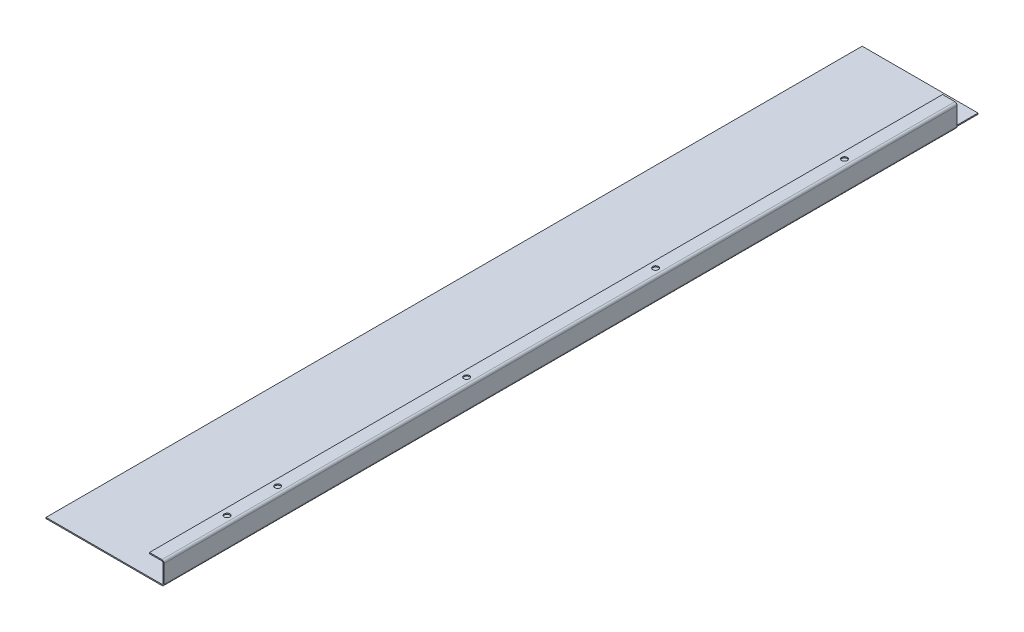
ISO-10303-21;
HEADER;
FILE_DESCRIPTION(('STEP AP214'),'2;1');
FILE_NAME('part.step','',(''),(''),'','','');
FILE_SCHEMA(('AUTOMOTIVE_DESIGN { 1 0 10303 214 1 1 1 1 }'));
ENDSEC;
DATA;
#1=APPLICATION_CONTEXT('core data for automotive mechanical design processes');
#2=APPLICATION_PROTOCOL_DEFINITION('international standard','automotive_design',2000,#1);
#3=PRODUCT_CONTEXT('',#1,'mechanical');
#4=PRODUCT('Part','Part','',(#3));
#5=PRODUCT_RELATED_PRODUCT_CATEGORY('part','',(#4));
#6=PRODUCT_DEFINITION_FORMATION('','',#4);
#7=PRODUCT_DEFINITION_CONTEXT('part definition',#1,'design');
#8=PRODUCT_DEFINITION('design','',#6,#7);
#9=PRODUCT_DEFINITION_SHAPE('','',#8);
#10=(LENGTH_UNIT() NAMED_UNIT(*) SI_UNIT(.MILLI.,.METRE.));
#11=(NAMED_UNIT(*) PLANE_ANGLE_UNIT() SI_UNIT($,.RADIAN.));
#12=(NAMED_UNIT(*) SI_UNIT($,.STERADIAN.) SOLID_ANGLE_UNIT());
#13=UNCERTAINTY_MEASURE_WITH_UNIT(LENGTH_MEASURE(1.E-05),#10,'distance_accuracy_value','');
#14=(GEOMETRIC_REPRESENTATION_CONTEXT(3) GLOBAL_UNCERTAINTY_ASSIGNED_CONTEXT((#13)) GLOBAL_UNIT_ASSIGNED_CONTEXT((#10,
#11,#12)) REPRESENTATION_CONTEXT('',''));
#15=CARTESIAN_POINT('',(0.,0.,0.));
#16=DIRECTION('',(0.,0.,1.));
#17=DIRECTION('',(1.,0.,0.));
#18=AXIS2_PLACEMENT_3D('',#15,#16,#17);
#19=CARTESIAN_POINT('',(105.,-3.86956670765295E-13,0.));
#20=DIRECTION('',(-1.,0.,0.));
#21=DIRECTION('',(0.,-1.,0.));
#22=AXIS2_PLACEMENT_3D('',#19,#20,#21);
#23=PLANE('',#22);
#24=DIRECTION('',(0.,-1.,0.));
#25=VECTOR('',#24,1.);
#26=CARTESIAN_POINT('',(105.,-3.83465189426452E-13,-705.2));
#27=LINE('',#26,#25);
#28=CARTESIAN_POINT('',(105.,17.,-705.2));
#29=VERTEX_POINT('',#28);
#30=CARTESIAN_POINT('',(105.,0.999999999999959,-705.2));
#31=VERTEX_POINT('',#30);
#32=EDGE_CURVE('E346',#29,#31,#27,.T.);
#33=ORIENTED_EDGE('',*,*,#32,.F.);
#34=DIRECTION('',(0.,0.,-1.));
#35=VECTOR('',#34,1.);
#36=CARTESIAN_POINT('',(105.,17.,-725.7));
#37=LINE('',#36,#35);
#38=CARTESIAN_POINT('',(105.,17.,0.));
#39=VERTEX_POINT('',#38);
#40=EDGE_CURVE('E216',#29,#39,#37,.F.);
#41=ORIENTED_EDGE('',*,*,#40,.T.);
#42=DIRECTION('',(0.,-1.,0.));
#43=VECTOR('',#42,1.);
#44=CARTESIAN_POINT('',(105.,-3.86956670765295E-13,0.));
#45=LINE('',#44,#43);
#46=CARTESIAN_POINT('',(105.,0.999999999999983,0.));
#47=VERTEX_POINT('',#46);
#48=EDGE_CURVE('E229',#39,#47,#45,.T.);
#49=ORIENTED_EDGE('',*,*,#48,.T.);
#50=DIRECTION('',(0.,0.,-1.));
#51=VECTOR('',#50,1.);
#52=CARTESIAN_POINT('',(105.,0.999999999999997,0.));
#53=LINE('',#52,#51);
#54=EDGE_CURVE('E235',#31,#47,#53,.F.);
#55=ORIENTED_EDGE('',*,*,#54,.F.);
#56=EDGE_LOOP('',(#33,#41,#49,#55));
#57=FACE_BOUND('',#56,.T.);
#58=ADVANCED_FACE('F78',(#57),#23,.F.);
#59=CARTESIAN_POINT('',(104.,-3.83465189426452E-13,0.));
#60=DIRECTION('',(-1.,0.,0.));
#61=DIRECTION('',(0.,-1.,0.));
#62=AXIS2_PLACEMENT_3D('',#59,#60,#61);
#63=PLANE('',#62);
#64=DIRECTION('',(0.,0.,-1.));
#65=VECTOR('',#64,1.);
#66=CARTESIAN_POINT('',(104.,17.,-725.7));
#67=LINE('',#66,#65);
#68=CARTESIAN_POINT('',(104.,17.,-705.2));
#69=VERTEX_POINT('',#68);
#70=CARTESIAN_POINT('',(104.,17.,0.));
#71=VERTEX_POINT('',#70);
#72=EDGE_CURVE('E223',#69,#71,#67,.F.);
#73=ORIENTED_EDGE('',*,*,#72,.F.);
#74=DIRECTION('',(0.,-1.,0.));
#75=VECTOR('',#74,1.);
#76=CARTESIAN_POINT('',(104.,-3.83304621342186E-13,-705.2));
#77=LINE('',#76,#75);
#78=CARTESIAN_POINT('',(104.,0.999999999999987,-705.2));
#79=VERTEX_POINT('',#78);
#80=EDGE_CURVE('E347',#69,#79,#77,.T.);
#81=ORIENTED_EDGE('',*,*,#80,.T.);
#82=DIRECTION('',(0.,0.,-1.));
#83=VECTOR('',#82,1.);
#84=CARTESIAN_POINT('',(104.,1.,0.));
#85=LINE('',#84,#83);
#86=CARTESIAN_POINT('',(104.,0.999999999999987,0.));
#87=VERTEX_POINT('',#86);
#88=EDGE_CURVE('E237',#87,#79,#85,.T.);
#89=ORIENTED_EDGE('',*,*,#88,.F.);
#90=DIRECTION('',(0.,1.,0.));
#91=VECTOR('',#90,1.);
#92=CARTESIAN_POINT('',(104.,0.,0.));
#93=LINE('',#92,#91);
#94=EDGE_CURVE('E233',#71,#87,#93,.F.);
#95=ORIENTED_EDGE('',*,*,#94,.F.);
#96=EDGE_LOOP('',(#73,#81,#89,#95));
#97=FACE_BOUND('',#96,.T.);
#98=ADVANCED_FACE('F388',(#97),#63,.T.);
#99=CARTESIAN_POINT('',(103.,0.999999999999991,-725.7));
#100=DIRECTION('',(0.,0.,-1.));
#101=DIRECTION('',(1.,0.,0.));
#102=AXIS2_PLACEMENT_3D('',#99,#100,#101);
#103=CYLINDRICAL_SURFACE('',#102,2.00000000000006);
#104=DIRECTION('',(0.,0.,-1.));
#105=VECTOR('',#104,1.);
#106=CARTESIAN_POINT('',(103.,-1.00000000000007,-725.7));
#107=LINE('',#106,#105);
#108=CARTESIAN_POINT('',(103.,-1.00000000000007,-705.2));
#109=VERTEX_POINT('',#108);
#110=CARTESIAN_POINT('',(103.,-1.,0.));
#111=VERTEX_POINT('',#110);
#112=EDGE_CURVE('E103',#109,#111,#107,.F.);
#113=ORIENTED_EDGE('',*,*,#112,.F.);
#114=CARTESIAN_POINT('',(103.,0.999999999999934,-705.2));
#115=DIRECTION('',(0.,0.,1.));
#116=DIRECTION('',(1.,0.,0.));
#117=AXIS2_PLACEMENT_3D('',#114,#115,#116);
#118=CIRCLE('',#117,2.);
#119=EDGE_CURVE('E318',#109,#31,#118,.T.);
#120=ORIENTED_EDGE('',*,*,#119,.T.);
#121=ORIENTED_EDGE('',*,*,#54,.T.);
#122=CARTESIAN_POINT('',(103.,0.999999999999991,0.));
#123=DIRECTION('',(0.,0.,-1.));
#124=DIRECTION('',(-1.,0.,0.));
#125=AXIS2_PLACEMENT_3D('',#122,#123,#124);
#126=CIRCLE('',#125,2.00000000000006);
#127=EDGE_CURVE('E244',#111,#47,#126,.F.);
#128=ORIENTED_EDGE('',*,*,#127,.F.);
#129=EDGE_LOOP('',(#113,#120,#121,#128));
#130=FACE_BOUND('',#129,.T.);
#131=ADVANCED_FACE('F394',(#130),#103,.T.);
#132=CARTESIAN_POINT('',(103.,0.999999999999991,-725.7));
#133=DIRECTION('',(0.,0.,-1.));
#134=DIRECTION('',(1.,0.,0.));
#135=AXIS2_PLACEMENT_3D('',#132,#133,#134);
#136=CYLINDRICAL_SURFACE('',#135,1.00000000000006);
#137=CARTESIAN_POINT('',(103.,0.999999999999934,-705.2));
#138=DIRECTION('',(0.,0.,1.));
#139=DIRECTION('',(1.,0.,0.));
#140=AXIS2_PLACEMENT_3D('',#137,#138,#139);
#141=CIRCLE('',#140,1.);
#142=CARTESIAN_POINT('',(103.,0.,-705.2));
#143=VERTEX_POINT('',#142);
#144=EDGE_CURVE('E324',#143,#79,#141,.T.);
#145=ORIENTED_EDGE('',*,*,#144,.F.);
#146=DIRECTION('',(0.,0.,-1.));
#147=VECTOR('',#146,1.);
#148=CARTESIAN_POINT('',(103.,0.,-725.7));
#149=LINE('',#148,#147);
#150=CARTESIAN_POINT('',(103.,0.,0.));
#151=VERTEX_POINT('',#150);
#152=EDGE_CURVE('E232',#143,#151,#149,.F.);
#153=ORIENTED_EDGE('',*,*,#152,.T.);
#154=CARTESIAN_POINT('',(103.,0.999999999999991,0.));
#155=DIRECTION('',(0.,0.,-1.));
#156=DIRECTION('',(-1.,0.,0.));
#157=AXIS2_PLACEMENT_3D('',#154,#155,#156);
#158=CIRCLE('',#157,1.00000000000006);
#159=EDGE_CURVE('E248',#151,#87,#158,.F.);
#160=ORIENTED_EDGE('',*,*,#159,.T.);
#161=ORIENTED_EDGE('',*,*,#88,.T.);
#162=EDGE_LOOP('',(#145,#153,#160,#161));
#163=FACE_BOUND('',#162,.T.);
#164=ADVANCED_FACE('F409',(#163),#136,.F.);
#165=CARTESIAN_POINT('',(103.,17.,-725.7));
#166=DIRECTION('',(0.,0.,-1.));
#167=DIRECTION('',(0.,1.,0.));
#168=AXIS2_PLACEMENT_3D('',#165,#166,#167);
#169=CYLINDRICAL_SURFACE('',#168,2.);
#170=ORIENTED_EDGE('',*,*,#40,.F.);
#171=CARTESIAN_POINT('',(103.,17.,-705.2));
#172=DIRECTION('',(0.,0.,1.));
#173=DIRECTION('',(1.,0.,0.));
#174=AXIS2_PLACEMENT_3D('',#171,#172,#173);
#175=CIRCLE('',#174,2.);
#176=CARTESIAN_POINT('',(103.,19.0000000000001,-705.2));
#177=VERTEX_POINT('',#176);
#178=EDGE_CURVE('E182',#29,#177,#175,.T.);
#179=ORIENTED_EDGE('',*,*,#178,.T.);
#180=DIRECTION('',(0.,0.,-1.));
#181=VECTOR('',#180,1.);
#182=CARTESIAN_POINT('',(103.,19.,0.));
#183=LINE('',#182,#181);
#184=CARTESIAN_POINT('',(103.,19.,0.));
#185=VERTEX_POINT('',#184);
#186=EDGE_CURVE('E208',#177,#185,#183,.F.);
#187=ORIENTED_EDGE('',*,*,#186,.T.);
#188=CARTESIAN_POINT('',(103.,17.,0.));
#189=DIRECTION('',(0.,0.,-1.));
#190=DIRECTION('',(-1.,0.,0.));
#191=AXIS2_PLACEMENT_3D('',#188,#189,#190);
#192=CIRCLE('',#191,2.);
#193=EDGE_CURVE('E218',#39,#185,#192,.F.);
#194=ORIENTED_EDGE('',*,*,#193,.F.);
#195=EDGE_LOOP('',(#170,#179,#187,#194));
#196=FACE_BOUND('',#195,.T.);
#197=ADVANCED_FACE('F413',(#196),#169,.T.);
#198=CARTESIAN_POINT('',(103.,17.,-725.7));
#199=DIRECTION('',(0.,0.,-1.));
#200=DIRECTION('',(0.,1.,0.));
#201=AXIS2_PLACEMENT_3D('',#198,#199,#200);
#202=CYLINDRICAL_SURFACE('',#201,1.);
#203=CARTESIAN_POINT('',(103.,17.,-705.2));
#204=DIRECTION('',(0.,0.,1.));
#205=DIRECTION('',(1.,0.,0.));
#206=AXIS2_PLACEMENT_3D('',#203,#204,#205);
#207=CIRCLE('',#206,1.);
#208=CARTESIAN_POINT('',(103.,18.,-705.2));
#209=VERTEX_POINT('',#208);
#210=EDGE_CURVE('E183',#69,#209,#207,.T.);
#211=ORIENTED_EDGE('',*,*,#210,.F.);
#212=ORIENTED_EDGE('',*,*,#72,.T.);
#213=CARTESIAN_POINT('',(103.,17.,0.));
#214=DIRECTION('',(0.,0.,-1.));
#215=DIRECTION('',(-1.,0.,0.));
#216=AXIS2_PLACEMENT_3D('',#213,#214,#215);
#217=CIRCLE('',#216,1.);
#218=CARTESIAN_POINT('',(103.,18.,0.));
#219=VERTEX_POINT('',#218);
#220=EDGE_CURVE('E207',#71,#219,#217,.F.);
#221=ORIENTED_EDGE('',*,*,#220,.T.);
#222=DIRECTION('',(0.,0.,-1.));
#223=VECTOR('',#222,1.);
#224=CARTESIAN_POINT('',(103.,18.,0.));
#225=LINE('',#224,#223);
#226=EDGE_CURVE('E199',#219,#209,#225,.T.);
#227=ORIENTED_EDGE('',*,*,#226,.T.);
#228=EDGE_LOOP('',(#211,#212,#221,#227));
#229=FACE_BOUND('',#228,.T.);
#230=ADVANCED_FACE('F205',(#229),#202,.F.);
#231=CARTESIAN_POINT('',(1.40823756520346E-13,19.0000000000008,0.));
#232=DIRECTION('',(0.,-1.,0.));
#233=DIRECTION('',(1.,0.,0.));
#234=AXIS2_PLACEMENT_3D('',#231,#232,#233);
#235=PLANE('',#234);
#236=CARTESIAN_POINT('',(97.9999999999838,19.,-612.));
#237=DIRECTION('',(0.,1.,0.));
#238=DIRECTION('',(-1.,0.,0.));
#239=AXIS2_PLACEMENT_3D('',#236,#237,#238);
#240=CIRCLE('',#239,2.5);
#241=CARTESIAN_POINT('',(95.4999999999838,19.0000000000001,-612.));
#242=VERTEX_POINT('',#241);
#243=EDGE_CURVE('E315',#242,#242,#240,.T.);
#244=ORIENTED_EDGE('',*,*,#243,.F.);
#245=EDGE_LOOP('',(#244));
#246=FACE_BOUND('',#245,.T.);
#247=CARTESIAN_POINT('',(97.9999999999892,19.,-444.));
#248=DIRECTION('',(0.,1.,0.));
#249=DIRECTION('',(-1.,0.,0.));
#250=AXIS2_PLACEMENT_3D('',#247,#248,#249);
#251=CIRCLE('',#250,2.5);
#252=CARTESIAN_POINT('',(95.4999999999892,19.0000000000001,-444.));
#253=VERTEX_POINT('',#252);
#254=EDGE_CURVE('E317',#253,#253,#251,.T.);
#255=ORIENTED_EDGE('',*,*,#254,.F.);
#256=EDGE_LOOP('',(#255));
#257=FACE_BOUND('',#256,.T.);
#258=CARTESIAN_POINT('',(97.9999999999945,19.,-276.));
#259=DIRECTION('',(0.,1.,0.));
#260=DIRECTION('',(-1.,0.,0.));
#261=AXIS2_PLACEMENT_3D('',#258,#259,#260);
#262=CIRCLE('',#261,2.50000000000001);
#263=CARTESIAN_POINT('',(95.4999999999945,19.0000000000001,-276.));
#264=VERTEX_POINT('',#263);
#265=EDGE_CURVE('E321',#264,#264,#262,.T.);
#266=ORIENTED_EDGE('',*,*,#265,.F.);
#267=EDGE_LOOP('',(#266));
#268=FACE_BOUND('',#267,.T.);
#269=CARTESIAN_POINT('',(97.9999999999999,19.,-108.));
#270=DIRECTION('',(0.,1.,0.));
#271=DIRECTION('',(-1.,0.,0.));
#272=AXIS2_PLACEMENT_3D('',#269,#270,#271);
#273=CIRCLE('',#272,2.50000000000001);
#274=CARTESIAN_POINT('',(95.4999999999999,19.0000000000001,-108.));
#275=VERTEX_POINT('',#274);
#276=EDGE_CURVE('E362',#275,#275,#273,.T.);
#277=ORIENTED_EDGE('',*,*,#276,.F.);
#278=EDGE_LOOP('',(#277));
#279=FACE_BOUND('',#278,.T.);
#280=CARTESIAN_POINT('',(97.9999999999999,19.,-63.));
#281=DIRECTION('',(0.,1.,0.));
#282=DIRECTION('',(-1.,0.,0.));
#283=AXIS2_PLACEMENT_3D('',#280,#281,#282);
#284=CIRCLE('',#283,2.5);
#285=CARTESIAN_POINT('',(95.4999999999999,19.0000000000001,-63.));
#286=VERTEX_POINT('',#285);
#287=EDGE_CURVE('E280',#286,#286,#284,.T.);
#288=ORIENTED_EDGE('',*,*,#287,.F.);
#289=EDGE_LOOP('',(#288));
#290=FACE_BOUND('',#289,.T.);
#291=DIRECTION('',(1.,0.,0.));
#292=VECTOR('',#291,1.);
#293=CARTESIAN_POINT('',(-2.35922392732846E-13,19.0000000000004,-705.2));
#294=LINE('',#293,#292);
#295=CARTESIAN_POINT('',(92.,19.0000000000001,-705.2));
#296=VERTEX_POINT('',#295);
#297=EDGE_CURVE('E179',#296,#177,#294,.T.);
#298=ORIENTED_EDGE('',*,*,#297,.F.);
#299=DIRECTION('',(0.,0.,1.));
#300=VECTOR('',#299,1.);
#301=CARTESIAN_POINT('',(92.0000000000001,19.0000000000001,0.));
#302=LINE('',#301,#300);
#303=CARTESIAN_POINT('',(92.0000000000001,19.0000000000001,0.));
#304=VERTEX_POINT('',#303);
#305=EDGE_CURVE('E333',#296,#304,#302,.T.);
#306=ORIENTED_EDGE('',*,*,#305,.T.);
#307=DIRECTION('',(1.,0.,0.));
#308=VECTOR('',#307,1.);
#309=CARTESIAN_POINT('',(1.40823756520346E-13,19.0000000000008,0.));
#310=LINE('',#309,#308);
#311=EDGE_CURVE('E330',#304,#185,#310,.T.);
#312=ORIENTED_EDGE('',*,*,#311,.T.);
#313=ORIENTED_EDGE('',*,*,#186,.F.);
#314=EDGE_LOOP('',(#298,#306,#312,#313));
#315=FACE_BOUND('',#314,.T.);
#316=ADVANCED_FACE('F298',(#246,#257,#268,#279,#290,#315),#235,.F.);
#317=CARTESIAN_POINT('',(1.33680225758394E-13,18.0000000000008,0.));
#318=DIRECTION('',(0.,-1.,0.));
#319=DIRECTION('',(1.,0.,0.));
#320=AXIS2_PLACEMENT_3D('',#317,#318,#319);
#321=PLANE('',#320);
#322=CARTESIAN_POINT('',(97.9999999999999,18.,-63.));
#323=DIRECTION('',(0.,-1.,0.));
#324=DIRECTION('',(1.,0.,0.));
#325=AXIS2_PLACEMENT_3D('',#322,#323,#324);
#326=CIRCLE('',#325,2.5);
#327=CARTESIAN_POINT('',(100.5,18.,-63.));
#328=VERTEX_POINT('',#327);
#329=EDGE_CURVE('E82',#328,#328,#326,.T.);
#330=ORIENTED_EDGE('',*,*,#329,.F.);
#331=EDGE_LOOP('',(#330));
#332=FACE_BOUND('',#331,.T.);
#333=CARTESIAN_POINT('',(97.9999999999999,18.,-108.));
#334=DIRECTION('',(0.,-1.,0.));
#335=DIRECTION('',(1.,0.,0.));
#336=AXIS2_PLACEMENT_3D('',#333,#334,#335);
#337=CIRCLE('',#336,2.50000000000001);
#338=CARTESIAN_POINT('',(100.5,18.,-108.));
#339=VERTEX_POINT('',#338);
#340=EDGE_CURVE('E285',#339,#339,#337,.T.);
#341=ORIENTED_EDGE('',*,*,#340,.F.);
#342=EDGE_LOOP('',(#341));
#343=FACE_BOUND('',#342,.T.);
#344=CARTESIAN_POINT('',(97.9999999999945,18.,-276.));
#345=DIRECTION('',(0.,-1.,0.));
#346=DIRECTION('',(1.,0.,0.));
#347=AXIS2_PLACEMENT_3D('',#344,#345,#346);
#348=CIRCLE('',#347,2.50000000000001);
#349=CARTESIAN_POINT('',(100.499999999995,18.,-276.));
#350=VERTEX_POINT('',#349);
#351=EDGE_CURVE('E283',#350,#350,#348,.T.);
#352=ORIENTED_EDGE('',*,*,#351,.F.);
#353=EDGE_LOOP('',(#352));
#354=FACE_BOUND('',#353,.T.);
#355=CARTESIAN_POINT('',(97.9999999999892,18.,-444.));
#356=DIRECTION('',(0.,-1.,0.));
#357=DIRECTION('',(1.,0.,0.));
#358=AXIS2_PLACEMENT_3D('',#355,#356,#357);
#359=CIRCLE('',#358,2.5);
#360=CARTESIAN_POINT('',(100.499999999989,18.,-444.));
#361=VERTEX_POINT('',#360);
#362=EDGE_CURVE('E279',#361,#361,#359,.T.);
#363=ORIENTED_EDGE('',*,*,#362,.F.);
#364=EDGE_LOOP('',(#363));
#365=FACE_BOUND('',#364,.T.);
#366=CARTESIAN_POINT('',(97.9999999999838,18.,-612.));
#367=DIRECTION('',(0.,-1.,0.));
#368=DIRECTION('',(1.,0.,0.));
#369=AXIS2_PLACEMENT_3D('',#366,#367,#368);
#370=CIRCLE('',#369,2.5);
#371=CARTESIAN_POINT('',(100.499999999984,18.,-612.));
#372=VERTEX_POINT('',#371);
#373=EDGE_CURVE('E276',#372,#372,#370,.T.);
#374=ORIENTED_EDGE('',*,*,#373,.F.);
#375=EDGE_LOOP('',(#374));
#376=FACE_BOUND('',#375,.T.);
#377=DIRECTION('',(0.,0.,-1.));
#378=VECTOR('',#377,1.);
#379=CARTESIAN_POINT('',(92.0000000000001,18.0000000000001,0.));
#380=LINE('',#379,#378);
#381=CARTESIAN_POINT('',(92.,18.0000000000001,-705.2));
#382=VERTEX_POINT('',#381);
#383=CARTESIAN_POINT('',(92.0000000000001,18.0000000000001,0.));
#384=VERTEX_POINT('',#383);
#385=EDGE_CURVE('E201',#382,#384,#380,.F.);
#386=ORIENTED_EDGE('',*,*,#385,.F.);
#387=DIRECTION('',(1.,0.,0.));
#388=VECTOR('',#387,1.);
#389=CARTESIAN_POINT('',(1.33595742037109E-13,18.0000000000008,-705.2));
#390=LINE('',#389,#388);
#391=EDGE_CURVE('E95',#382,#209,#390,.T.);
#392=ORIENTED_EDGE('',*,*,#391,.T.);
#393=ORIENTED_EDGE('',*,*,#226,.F.);
#394=DIRECTION('',(-1.,0.,0.));
#395=VECTOR('',#394,1.);
#396=CARTESIAN_POINT('',(104.,18.,0.));
#397=LINE('',#396,#395);
#398=EDGE_CURVE('E335',#384,#219,#397,.F.);
#399=ORIENTED_EDGE('',*,*,#398,.F.);
#400=EDGE_LOOP('',(#386,#392,#393,#399));
#401=FACE_BOUND('',#400,.T.);
#402=ADVANCED_FACE('F197',(#332,#343,#354,#365,#376,#401),#321,.T.);
#403=CARTESIAN_POINT('',(92.0000000000001,19.0000000000001,0.));
#404=DIRECTION('',(1.,0.,0.));
#405=DIRECTION('',(0.,1.,0.));
#406=AXIS2_PLACEMENT_3D('',#403,#404,#405);
#407=PLANE('',#406);
#408=DIRECTION('',(0.,1.,0.));
#409=VECTOR('',#408,1.);
#410=CARTESIAN_POINT('',(92.,19.0000000000001,-705.2));
#411=LINE('',#410,#409);
#412=EDGE_CURVE('E202',#296,#382,#411,.F.);
#413=ORIENTED_EDGE('',*,*,#412,.T.);
#414=ORIENTED_EDGE('',*,*,#385,.T.);
#415=DIRECTION('',(0.,-1.,0.));
#416=VECTOR('',#415,1.);
#417=CARTESIAN_POINT('',(92.0000000000001,19.0000000000001,0.));
#418=LINE('',#417,#416);
#419=EDGE_CURVE('E225',#304,#384,#418,.T.);
#420=ORIENTED_EDGE('',*,*,#419,.F.);
#421=ORIENTED_EDGE('',*,*,#305,.F.);
#422=EDGE_LOOP('',(#413,#414,#420,#421));
#423=FACE_BOUND('',#422,.T.);
#424=ADVANCED_FACE('F297',(#423),#407,.F.);
#425=CARTESIAN_POINT('',(105.,0.,0.));
#426=DIRECTION('',(0.,0.,-1.));
#427=DIRECTION('',(0.,1.,0.));
#428=AXIS2_PLACEMENT_3D('',#425,#426,#427);
#429=PLANE('',#428);
#430=DIRECTION('',(1.,0.,0.));
#431=VECTOR('',#430,1.);
#432=CARTESIAN_POINT('',(104.,17.,0.));
#433=LINE('',#432,#431);
#434=EDGE_CURVE('E221',#71,#39,#433,.T.);
#435=ORIENTED_EDGE('',*,*,#434,.F.);
#436=ORIENTED_EDGE('',*,*,#94,.T.);
#437=DIRECTION('',(-1.,0.,0.));
#438=VECTOR('',#437,1.);
#439=CARTESIAN_POINT('',(105.,0.999999999999997,0.));
#440=LINE('',#439,#438);
#441=EDGE_CURVE('E228',#87,#47,#440,.F.);
#442=ORIENTED_EDGE('',*,*,#441,.T.);
#443=ORIENTED_EDGE('',*,*,#48,.F.);
#444=EDGE_LOOP('',(#435,#436,#442,#443));
#445=FACE_BOUND('',#444,.T.);
#446=ADVANCED_FACE('F402',(#445),#429,.F.);
#447=CARTESIAN_POINT('',(-1.11022302462516E-13,-1.,-725.7));
#448=DIRECTION('',(0.,0.,-1.));
#449=DIRECTION('',(-1.,0.,0.));
#450=AXIS2_PLACEMENT_3D('',#447,#448,#449);
#451=PLANE('',#450);
#452=DIRECTION('',(-1.,0.,0.));
#453=VECTOR('',#452,1.);
#454=CARTESIAN_POINT('',(-1.11022302462516E-13,0.,-725.7));
#455=LINE('',#454,#453);
#456=CARTESIAN_POINT('',(103.,0.,-725.7));
#457=VERTEX_POINT('',#456);
#458=CARTESIAN_POINT('',(-1.11022302462516E-13,0.,-725.7));
#459=VERTEX_POINT('',#458);
#460=EDGE_CURVE('E264',#457,#459,#455,.T.);
#461=ORIENTED_EDGE('',*,*,#460,.F.);
#462=DIRECTION('',(0.,-1.,0.));
#463=VECTOR('',#462,1.);
#464=CARTESIAN_POINT('',(103.,0.,-725.7));
#465=LINE('',#464,#463);
#466=CARTESIAN_POINT('',(103.,-1.00000000000007,-725.7));
#467=VERTEX_POINT('',#466);
#468=EDGE_CURVE('E247',#457,#467,#465,.T.);
#469=ORIENTED_EDGE('',*,*,#468,.T.);
#470=DIRECTION('',(-1.,0.,0.));
#471=VECTOR('',#470,1.);
#472=CARTESIAN_POINT('',(-1.11022302462516E-13,-1.,-725.7));
#473=LINE('',#472,#471);
#474=CARTESIAN_POINT('',(-1.11022302462516E-13,-1.,-725.7));
#475=VERTEX_POINT('',#474);
#476=EDGE_CURVE('E267',#467,#475,#473,.T.);
#477=ORIENTED_EDGE('',*,*,#476,.T.);
#478=DIRECTION('',(0.,1.,0.));
#479=VECTOR('',#478,1.);
#480=CARTESIAN_POINT('',(-1.11022302462516E-13,-1.,-725.7));
#481=LINE('',#480,#479);
#482=EDGE_CURVE('E13',#475,#459,#481,.T.);
#483=ORIENTED_EDGE('',*,*,#482,.T.);
#484=EDGE_LOOP('',(#461,#469,#477,#483));
#485=FACE_BOUND('',#484,.T.);
#486=ADVANCED_FACE('F405',(#485),#451,.T.);
#487=CARTESIAN_POINT('',(0.,-1.,0.));
#488=DIRECTION('',(0.,-1.,0.));
#489=DIRECTION('',(0.,0.,-1.));
#490=AXIS2_PLACEMENT_3D('',#487,#488,#489);
#491=PLANE('',#490);
#492=ORIENTED_EDGE('',*,*,#476,.F.);
#493=EDGE_CURVE('E242',#467,#109,#107,.F.);
#494=ORIENTED_EDGE('',*,*,#493,.T.);
#495=ORIENTED_EDGE('',*,*,#112,.T.);
#496=DIRECTION('',(1.,0.,0.));
#497=VECTOR('',#496,1.);
#498=CARTESIAN_POINT('',(0.,-1.,0.));
#499=LINE('',#498,#497);
#500=CARTESIAN_POINT('',(0.,-1.,0.));
#501=VERTEX_POINT('',#500);
#502=EDGE_CURVE('E263',#501,#111,#499,.T.);
#503=ORIENTED_EDGE('',*,*,#502,.F.);
#504=DIRECTION('',(0.,0.,1.));
#505=VECTOR('',#504,1.);
#506=CARTESIAN_POINT('',(0.,-1.,0.));
#507=LINE('',#506,#505);
#508=EDGE_CURVE('E260',#475,#501,#507,.T.);
#509=ORIENTED_EDGE('',*,*,#508,.F.);
#510=EDGE_LOOP('',(#492,#494,#495,#503,#509));
#511=FACE_BOUND('',#510,.T.);
#512=ADVANCED_FACE('F420',(#511),#491,.T.);
#513=CARTESIAN_POINT('',(0.,0.,0.));
#514=DIRECTION('',(0.,-1.,0.));
#515=DIRECTION('',(0.,0.,-1.));
#516=AXIS2_PLACEMENT_3D('',#513,#514,#515);
#517=PLANE('',#516);
#518=EDGE_CURVE('E251',#457,#143,#149,.F.);
#519=ORIENTED_EDGE('',*,*,#518,.F.);
#520=ORIENTED_EDGE('',*,*,#460,.T.);
#521=DIRECTION('',(0.,0.,1.));
#522=VECTOR('',#521,1.);
#523=CARTESIAN_POINT('',(0.,0.,0.));
#524=LINE('',#523,#522);
#525=CARTESIAN_POINT('',(0.,0.,0.));
#526=VERTEX_POINT('',#525);
#527=EDGE_CURVE('E257',#459,#526,#524,.T.);
#528=ORIENTED_EDGE('',*,*,#527,.T.);
#529=DIRECTION('',(1.,0.,0.));
#530=VECTOR('',#529,1.);
#531=CARTESIAN_POINT('',(0.,0.,0.));
#532=LINE('',#531,#530);
#533=EDGE_CURVE('E271',#526,#151,#532,.T.);
#534=ORIENTED_EDGE('',*,*,#533,.T.);
#535=ORIENTED_EDGE('',*,*,#152,.F.);
#536=EDGE_LOOP('',(#519,#520,#528,#534,#535));
#537=FACE_BOUND('',#536,.T.);
#538=ADVANCED_FACE('F423',(#537),#517,.F.);
#539=CARTESIAN_POINT('',(0.,-1.,0.));
#540=DIRECTION('',(-1.,0.,0.));
#541=DIRECTION('',(0.,0.,1.));
#542=AXIS2_PLACEMENT_3D('',#539,#540,#541);
#543=PLANE('',#542);
#544=ORIENTED_EDGE('',*,*,#527,.F.);
#545=ORIENTED_EDGE('',*,*,#482,.F.);
#546=ORIENTED_EDGE('',*,*,#508,.T.);
#547=DIRECTION('',(0.,1.,0.));
#548=VECTOR('',#547,1.);
#549=CARTESIAN_POINT('',(0.,-1.,0.));
#550=LINE('',#549,#548);
#551=EDGE_CURVE('E87',#501,#526,#550,.T.);
#552=ORIENTED_EDGE('',*,*,#551,.T.);
#553=EDGE_LOOP('',(#544,#545,#546,#552));
#554=FACE_BOUND('',#553,.T.);
#555=ADVANCED_FACE('F80',(#554),#543,.T.);
#556=CARTESIAN_POINT('',(0.,-1.,0.));
#557=DIRECTION('',(0.,0.,1.));
#558=DIRECTION('',(1.,0.,0.));
#559=AXIS2_PLACEMENT_3D('',#556,#557,#558);
#560=PLANE('',#559);
#561=DIRECTION('',(0.,-1.,0.));
#562=VECTOR('',#561,1.);
#563=CARTESIAN_POINT('',(103.,0.,0.));
#564=LINE('',#563,#562);
#565=EDGE_CURVE('E254',#151,#111,#564,.T.);
#566=ORIENTED_EDGE('',*,*,#565,.F.);
#567=ORIENTED_EDGE('',*,*,#533,.F.);
#568=ORIENTED_EDGE('',*,*,#551,.F.);
#569=ORIENTED_EDGE('',*,*,#502,.T.);
#570=EDGE_LOOP('',(#566,#567,#568,#569));
#571=FACE_BOUND('',#570,.T.);
#572=ADVANCED_FACE('F418',(#571),#560,.T.);
#573=CARTESIAN_POINT('',(103.,0.999999999999991,0.));
#574=DIRECTION('',(0.,0.,1.));
#575=DIRECTION('',(1.,0.,0.));
#576=AXIS2_PLACEMENT_3D('',#573,#574,#575);
#577=PLANE('',#576);
#578=ORIENTED_EDGE('',*,*,#441,.F.);
#579=ORIENTED_EDGE('',*,*,#159,.F.);
#580=ORIENTED_EDGE('',*,*,#565,.T.);
#581=ORIENTED_EDGE('',*,*,#127,.T.);
#582=EDGE_LOOP('',(#578,#579,#580,#581));
#583=FACE_BOUND('',#582,.T.);
#584=ADVANCED_FACE('F415',(#583),#577,.T.);
#585=CARTESIAN_POINT('',(103.,17.,0.));
#586=DIRECTION('',(0.,0.,1.));
#587=DIRECTION('',(1.,0.,0.));
#588=AXIS2_PLACEMENT_3D('',#585,#586,#587);
#589=PLANE('',#588);
#590=DIRECTION('',(0.,-1.,0.));
#591=VECTOR('',#590,1.);
#592=CARTESIAN_POINT('',(103.,19.,0.));
#593=LINE('',#592,#591);
#594=EDGE_CURVE('E209',#219,#185,#593,.F.);
#595=ORIENTED_EDGE('',*,*,#594,.F.);
#596=ORIENTED_EDGE('',*,*,#220,.F.);
#597=ORIENTED_EDGE('',*,*,#434,.T.);
#598=ORIENTED_EDGE('',*,*,#193,.T.);
#599=EDGE_LOOP('',(#595,#596,#597,#598));
#600=FACE_BOUND('',#599,.T.);
#601=ADVANCED_FACE('F399',(#600),#589,.T.);
#602=CARTESIAN_POINT('',(104.,19.,0.));
#603=DIRECTION('',(0.,0.,-1.));
#604=DIRECTION('',(-1.,0.,0.));
#605=AXIS2_PLACEMENT_3D('',#602,#603,#604);
#606=PLANE('',#605);
#607=ORIENTED_EDGE('',*,*,#594,.T.);
#608=ORIENTED_EDGE('',*,*,#311,.F.);
#609=ORIENTED_EDGE('',*,*,#419,.T.);
#610=ORIENTED_EDGE('',*,*,#398,.T.);
#611=EDGE_LOOP('',(#607,#608,#609,#610));
#612=FACE_BOUND('',#611,.T.);
#613=ADVANCED_FACE('F311',(#612),#606,.F.);
#614=CARTESIAN_POINT('',(97.9999999999838,9.00000000000004,-612.));
#615=DIRECTION('',(0.,1.,0.));
#616=DIRECTION('',(-1.,0.,0.));
#617=AXIS2_PLACEMENT_3D('',#614,#615,#616);
#618=CYLINDRICAL_SURFACE('',#617,2.5);
#619=ORIENTED_EDGE('',*,*,#373,.T.);
#620=EDGE_LOOP('',(#619));
#621=FACE_BOUND('',#620,.T.);
#622=ORIENTED_EDGE('',*,*,#243,.T.);
#623=EDGE_LOOP('',(#622));
#624=FACE_BOUND('',#623,.T.);
#625=ADVANCED_FACE('F307',(#621,#624),#618,.F.);
#626=CARTESIAN_POINT('',(97.9999999999891,9.00000000000004,-444.));
#627=DIRECTION('',(0.,1.,0.));
#628=DIRECTION('',(-1.,0.,0.));
#629=AXIS2_PLACEMENT_3D('',#626,#627,#628);
#630=CYLINDRICAL_SURFACE('',#629,2.5);
#631=ORIENTED_EDGE('',*,*,#362,.T.);
#632=EDGE_LOOP('',(#631));
#633=FACE_BOUND('',#632,.T.);
#634=ORIENTED_EDGE('',*,*,#254,.T.);
#635=EDGE_LOOP('',(#634));
#636=FACE_BOUND('',#635,.T.);
#637=ADVANCED_FACE('F310',(#633,#636),#630,.F.);
#638=CARTESIAN_POINT('',(97.9999999999945,9.00000000000004,-276.));
#639=DIRECTION('',(0.,1.,0.));
#640=DIRECTION('',(-1.,0.,0.));
#641=AXIS2_PLACEMENT_3D('',#638,#639,#640);
#642=CYLINDRICAL_SURFACE('',#641,2.50000000000001);
#643=ORIENTED_EDGE('',*,*,#351,.T.);
#644=EDGE_LOOP('',(#643));
#645=FACE_BOUND('',#644,.T.);
#646=ORIENTED_EDGE('',*,*,#265,.T.);
#647=EDGE_LOOP('',(#646));
#648=FACE_BOUND('',#647,.T.);
#649=ADVANCED_FACE('F367',(#645,#648),#642,.F.);
#650=CARTESIAN_POINT('',(97.9999999999998,9.00000000000004,-108.));
#651=DIRECTION('',(0.,1.,0.));
#652=DIRECTION('',(-1.,0.,0.));
#653=AXIS2_PLACEMENT_3D('',#650,#651,#652);
#654=CYLINDRICAL_SURFACE('',#653,2.50000000000001);
#655=ORIENTED_EDGE('',*,*,#340,.T.);
#656=EDGE_LOOP('',(#655));
#657=FACE_BOUND('',#656,.T.);
#658=ORIENTED_EDGE('',*,*,#276,.T.);
#659=EDGE_LOOP('',(#658));
#660=FACE_BOUND('',#659,.T.);
#661=ADVANCED_FACE('F377',(#657,#660),#654,.F.);
#662=CARTESIAN_POINT('',(97.9999999999999,9.00000000000004,-63.));
#663=DIRECTION('',(0.,1.,0.));
#664=DIRECTION('',(-1.,0.,0.));
#665=AXIS2_PLACEMENT_3D('',#662,#663,#664);
#666=CYLINDRICAL_SURFACE('',#665,2.5);
#667=ORIENTED_EDGE('',*,*,#329,.T.);
#668=EDGE_LOOP('',(#667));
#669=FACE_BOUND('',#668,.T.);
#670=ORIENTED_EDGE('',*,*,#287,.T.);
#671=EDGE_LOOP('',(#670));
#672=FACE_BOUND('',#671,.T.);
#673=ADVANCED_FACE('F292',(#669,#672),#666,.F.);
#674=CARTESIAN_POINT('',(103.,0.999999999999934,-705.2));
#675=DIRECTION('',(0.,0.,-1.));
#676=DIRECTION('',(-1.,0.,0.));
#677=AXIS2_PLACEMENT_3D('',#674,#675,#676);
#678=PLANE('',#677);
#679=DIRECTION('',(0.,-1.,0.));
#680=VECTOR('',#679,1.);
#681=CARTESIAN_POINT('',(103.,-3.76161090580234E-13,-705.2));
#682=LINE('',#681,#680);
#683=EDGE_CURVE('E356',#143,#109,#682,.T.);
#684=ORIENTED_EDGE('',*,*,#683,.F.);
#685=ORIENTED_EDGE('',*,*,#144,.T.);
#686=DIRECTION('',(-1.,0.,0.));
#687=VECTOR('',#686,1.);
#688=CARTESIAN_POINT('',(105.,0.999999999999959,-705.2));
#689=LINE('',#688,#687);
#690=EDGE_CURVE('E354',#31,#79,#689,.T.);
#691=ORIENTED_EDGE('',*,*,#690,.F.);
#692=ORIENTED_EDGE('',*,*,#119,.F.);
#693=EDGE_LOOP('',(#684,#685,#691,#692));
#694=FACE_BOUND('',#693,.T.);
#695=ADVANCED_FACE('F376',(#694),#678,.T.);
#696=CARTESIAN_POINT('',(103.,0.,-715.45));
#697=DIRECTION('',(-1.,0.,0.));
#698=DIRECTION('',(0.,0.,-1.));
#699=AXIS2_PLACEMENT_3D('',#696,#697,#698);
#700=PLANE('',#699);
#701=ORIENTED_EDGE('',*,*,#468,.F.);
#702=ORIENTED_EDGE('',*,*,#518,.T.);
#703=ORIENTED_EDGE('',*,*,#683,.T.);
#704=ORIENTED_EDGE('',*,*,#493,.F.);
#705=EDGE_LOOP('',(#701,#702,#703,#704));
#706=FACE_BOUND('',#705,.T.);
#707=ADVANCED_FACE('F383',(#706),#700,.F.);
#708=CARTESIAN_POINT('',(103.,17.,-705.2));
#709=DIRECTION('',(0.,0.,-1.));
#710=DIRECTION('',(-1.,0.,0.));
#711=AXIS2_PLACEMENT_3D('',#708,#709,#710);
#712=PLANE('',#711);
#713=ORIENTED_EDGE('',*,*,#210,.T.);
#714=DIRECTION('',(0.,-1.,0.));
#715=VECTOR('',#714,1.);
#716=CARTESIAN_POINT('',(103.,19.0000000000001,-705.2));
#717=LINE('',#716,#715);
#718=EDGE_CURVE('E175',#177,#209,#717,.T.);
#719=ORIENTED_EDGE('',*,*,#718,.F.);
#720=ORIENTED_EDGE('',*,*,#178,.F.);
#721=DIRECTION('',(-1.,0.,0.));
#722=VECTOR('',#721,1.);
#723=CARTESIAN_POINT('',(105.,17.,-705.2));
#724=LINE('',#723,#722);
#725=EDGE_CURVE('E189',#29,#69,#724,.T.);
#726=ORIENTED_EDGE('',*,*,#725,.T.);
#727=EDGE_LOOP('',(#713,#719,#720,#726));
#728=FACE_BOUND('',#727,.T.);
#729=ADVANCED_FACE('F187',(#728),#712,.T.);
#730=CARTESIAN_POINT('',(105.,-3.83465189426452E-13,-705.2));
#731=DIRECTION('',(0.,0.,-1.));
#732=DIRECTION('',(0.,-1.,0.));
#733=AXIS2_PLACEMENT_3D('',#730,#731,#732);
#734=PLANE('',#733);
#735=ORIENTED_EDGE('',*,*,#725,.F.);
#736=ORIENTED_EDGE('',*,*,#32,.T.);
#737=ORIENTED_EDGE('',*,*,#690,.T.);
#738=ORIENTED_EDGE('',*,*,#80,.F.);
#739=EDGE_LOOP('',(#735,#736,#737,#738));
#740=FACE_BOUND('',#739,.T.);
#741=ADVANCED_FACE('F459',(#740),#734,.T.);
#742=CARTESIAN_POINT('',(-2.35922392732846E-13,19.0000000000004,-705.2));
#743=DIRECTION('',(0.,0.,-1.));
#744=DIRECTION('',(1.,0.,0.));
#745=AXIS2_PLACEMENT_3D('',#742,#743,#744);
#746=PLANE('',#745);
#747=ORIENTED_EDGE('',*,*,#412,.F.);
#748=ORIENTED_EDGE('',*,*,#297,.T.);
#749=ORIENTED_EDGE('',*,*,#718,.T.);
#750=ORIENTED_EDGE('',*,*,#391,.F.);
#751=EDGE_LOOP('',(#747,#748,#749,#750));
#752=FACE_BOUND('',#751,.T.);
#753=ADVANCED_FACE('F177',(#752),#746,.T.);
#754=CLOSED_SHELL('',(#58,#98,#131,#164,#197,#230,#316,#402,#424,#446,#486,#512,#538,#555,#572,
#584,#601,#613,#625,#637,#649,#661,#673,#695,#707,#729,#741,#753));
#755=MANIFOLD_SOLID_BREP('B2',#754);
#756=ADVANCED_BREP_SHAPE_REPRESENTATION('',(#18,#755),#14);
#757=SHAPE_DEFINITION_REPRESENTATION(#9,#756);
ENDSEC;
END-ISO-10303-21;
